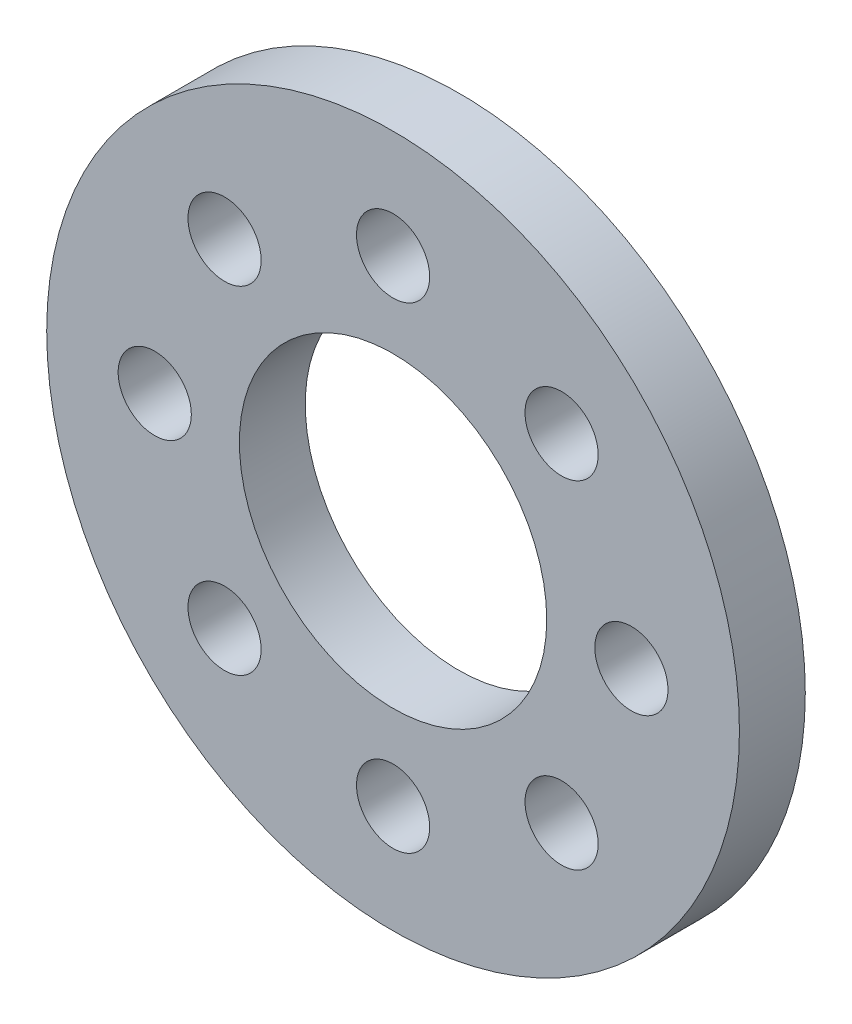
ISO-10303-21;
HEADER;
FILE_DESCRIPTION(('STEP AP214'),'2;1');
FILE_NAME('part.step','',(''),(''),'','','');
FILE_SCHEMA(('AUTOMOTIVE_DESIGN { 1 0 10303 214 1 1 1 1 }'));
ENDSEC;
DATA;
#1=APPLICATION_CONTEXT('core data for automotive mechanical design processes');
#2=APPLICATION_PROTOCOL_DEFINITION('international standard','automotive_design',2000,#1);
#3=PRODUCT_CONTEXT('',#1,'mechanical');
#4=PRODUCT('Part','Part','',(#3));
#5=PRODUCT_RELATED_PRODUCT_CATEGORY('part','',(#4));
#6=PRODUCT_DEFINITION_FORMATION('','',#4);
#7=PRODUCT_DEFINITION_CONTEXT('part definition',#1,'design');
#8=PRODUCT_DEFINITION('design','',#6,#7);
#9=PRODUCT_DEFINITION_SHAPE('','',#8);
#10=(LENGTH_UNIT() NAMED_UNIT(*) SI_UNIT(.MILLI.,.METRE.));
#11=(NAMED_UNIT(*) PLANE_ANGLE_UNIT() SI_UNIT($,.RADIAN.));
#12=(NAMED_UNIT(*) SI_UNIT($,.STERADIAN.) SOLID_ANGLE_UNIT());
#13=UNCERTAINTY_MEASURE_WITH_UNIT(LENGTH_MEASURE(1.E-05),#10,'distance_accuracy_value','');
#14=(GEOMETRIC_REPRESENTATION_CONTEXT(3) GLOBAL_UNCERTAINTY_ASSIGNED_CONTEXT((#13)) GLOBAL_UNIT_ASSIGNED_CONTEXT((#10,
#11,#12)) REPRESENTATION_CONTEXT('',''));
#15=CARTESIAN_POINT('',(0.,0.,0.));
#16=DIRECTION('',(0.,0.,1.));
#17=DIRECTION('',(1.,0.,0.));
#18=AXIS2_PLACEMENT_3D('',#15,#16,#17);
#19=CARTESIAN_POINT('',(0.,0.,2.7));
#20=DIRECTION('',(0.,0.,1.));
#21=DIRECTION('',(1.,0.,0.));
#22=AXIS2_PLACEMENT_3D('',#19,#20,#21);
#23=PLANE('',#22);
#24=CARTESIAN_POINT('',(-9.76999999999958,-4.16520151702571E-13,2.7));
#25=DIRECTION('',(0.,0.,1.));
#26=DIRECTION('',(1.,0.,0.));
#27=AXIS2_PLACEMENT_3D('',#24,#25,#26);
#28=CIRCLE('',#27,1.50000000000062);
#29=CARTESIAN_POINT('',(-8.26999999999896,-4.16520151702571E-13,2.7));
#30=VERTEX_POINT('',#29);
#31=EDGE_CURVE('E82',#30,#30,#28,.T.);
#32=ORIENTED_EDGE('',*,*,#31,.F.);
#33=EDGE_LOOP('',(#32));
#34=FACE_BOUND('',#33,.T.);
#35=CARTESIAN_POINT('',(8.31593995535348E-13,-9.77,2.7));
#36=DIRECTION('',(0.,0.,1.));
#37=DIRECTION('',(1.,0.,0.));
#38=AXIS2_PLACEMENT_3D('',#35,#36,#37);
#39=CIRCLE('',#38,1.50000000000086);
#40=CARTESIAN_POINT('',(1.50000000000169,-9.77,2.7));
#41=VERTEX_POINT('',#40);
#42=EDGE_CURVE('E70',#41,#41,#39,.T.);
#43=ORIENTED_EDGE('',*,*,#42,.F.);
#44=EDGE_LOOP('',(#43));
#45=FACE_BOUND('',#44,.T.);
#46=CARTESIAN_POINT('',(9.77000000000042,4.15323671779804E-13,2.7));
#47=DIRECTION('',(0.,0.,1.));
#48=DIRECTION('',(1.,0.,0.));
#49=AXIS2_PLACEMENT_3D('',#46,#47,#48);
#50=CIRCLE('',#49,1.50000000000031);
#51=CARTESIAN_POINT('',(11.2700000000007,4.15323671779804E-13,2.7));
#52=VERTEX_POINT('',#51);
#53=EDGE_CURVE('E58',#52,#52,#50,.T.);
#54=ORIENTED_EDGE('',*,*,#53,.F.);
#55=EDGE_LOOP('',(#54));
#56=FACE_BOUND('',#55,.T.);
#57=CARTESIAN_POINT('',(0.,9.77,2.7));
#58=DIRECTION('',(0.,0.,1.));
#59=DIRECTION('',(1.,0.,0.));
#60=AXIS2_PLACEMENT_3D('',#57,#58,#59);
#61=CIRCLE('',#60,1.5);
#62=CARTESIAN_POINT('',(1.5,9.77,2.7));
#63=VERTEX_POINT('',#62);
#64=EDGE_CURVE('E46',#63,#63,#61,.T.);
#65=ORIENTED_EDGE('',*,*,#64,.F.);
#66=EDGE_LOOP('',(#65));
#67=FACE_BOUND('',#66,.T.);
#68=CARTESIAN_POINT('',(0.,0.,2.7));
#69=DIRECTION('',(0.,0.,1.));
#70=DIRECTION('',(1.,0.,0.));
#71=AXIS2_PLACEMENT_3D('',#68,#69,#70);
#72=CIRCLE('',#71,14.2);
#73=CARTESIAN_POINT('',(14.2,0.,2.7));
#74=VERTEX_POINT('',#73);
#75=EDGE_CURVE('E10',#74,#74,#72,.T.);
#76=ORIENTED_EDGE('',*,*,#75,.T.);
#77=EDGE_LOOP('',(#76));
#78=FACE_BOUND('',#77,.T.);
#79=CARTESIAN_POINT('',(0.,0.,2.7));
#80=DIRECTION('',(0.,0.,1.));
#81=DIRECTION('',(1.,0.,0.));
#82=AXIS2_PLACEMENT_3D('',#79,#80,#81);
#83=CIRCLE('',#82,6.3);
#84=CARTESIAN_POINT('',(6.3,0.,2.7));
#85=VERTEX_POINT('',#84);
#86=EDGE_CURVE('E41',#85,#85,#83,.T.);
#87=ORIENTED_EDGE('',*,*,#86,.F.);
#88=EDGE_LOOP('',(#87));
#89=FACE_BOUND('',#88,.T.);
#90=CARTESIAN_POINT('',(6.90843325219269,6.90843325219286,2.7));
#91=DIRECTION('',(0.,0.,1.));
#92=DIRECTION('',(1.,0.,0.));
#93=AXIS2_PLACEMENT_3D('',#90,#91,#92);
#94=CIRCLE('',#93,1.50000000000005);
#95=CARTESIAN_POINT('',(8.40843325219274,6.90843325219286,2.7));
#96=VERTEX_POINT('',#95);
#97=EDGE_CURVE('E52',#96,#96,#94,.T.);
#98=ORIENTED_EDGE('',*,*,#97,.F.);
#99=EDGE_LOOP('',(#98));
#100=FACE_BOUND('',#99,.T.);
#101=CARTESIAN_POINT('',(6.90843325219328,-6.90843325219228,2.7));
#102=DIRECTION('',(0.,0.,1.));
#103=DIRECTION('',(1.,0.,0.));
#104=AXIS2_PLACEMENT_3D('',#101,#102,#103);
#105=CIRCLE('',#104,1.50000000000064);
#106=CARTESIAN_POINT('',(8.40843325219392,-6.90843325219228,2.7));
#107=VERTEX_POINT('',#106);
#108=EDGE_CURVE('E64',#107,#107,#105,.T.);
#109=ORIENTED_EDGE('',*,*,#108,.F.);
#110=EDGE_LOOP('',(#109));
#111=FACE_BOUND('',#110,.T.);
#112=CARTESIAN_POINT('',(-6.90843325219186,-6.90843325219286,2.7));
#113=DIRECTION('',(0.,0.,1.));
#114=DIRECTION('',(1.,0.,0.));
#115=AXIS2_PLACEMENT_3D('',#112,#113,#114);
#116=CIRCLE('',#115,1.50000000000085);
#117=CARTESIAN_POINT('',(-5.40843325219101,-6.90843325219286,2.7));
#118=VERTEX_POINT('',#117);
#119=EDGE_CURVE('E76',#118,#118,#116,.T.);
#120=ORIENTED_EDGE('',*,*,#119,.F.);
#121=EDGE_LOOP('',(#120));
#122=FACE_BOUND('',#121,.T.);
#123=CARTESIAN_POINT('',(-6.90843325219245,6.90843325219227,2.7));
#124=DIRECTION('',(0.,0.,1.));
#125=DIRECTION('',(1.,0.,0.));
#126=AXIS2_PLACEMENT_3D('',#123,#124,#125);
#127=CIRCLE('',#126,1.50000000000032);
#128=CARTESIAN_POINT('',(-5.40843325219213,6.90843325219227,2.7));
#129=VERTEX_POINT('',#128);
#130=EDGE_CURVE('E88',#129,#129,#127,.T.);
#131=ORIENTED_EDGE('',*,*,#130,.F.);
#132=EDGE_LOOP('',(#131));
#133=FACE_BOUND('',#132,.T.);
#134=ADVANCED_FACE('F30',(#34,#45,#56,#67,#78,#89,#100,#111,#122,#133),#23,.T.);
#135=CARTESIAN_POINT('',(0.,0.,0.));
#136=DIRECTION('',(0.,0.,1.));
#137=DIRECTION('',(1.,0.,0.));
#138=AXIS2_PLACEMENT_3D('',#135,#136,#137);
#139=PLANE('',#138);
#140=CARTESIAN_POINT('',(-9.76999999999958,-4.16520151702571E-13,0.));
#141=DIRECTION('',(0.,0.,1.));
#142=DIRECTION('',(1.,0.,0.));
#143=AXIS2_PLACEMENT_3D('',#140,#141,#142);
#144=CIRCLE('',#143,1.50000000000062);
#145=CARTESIAN_POINT('',(-8.26999999999896,-4.16520151702571E-13,0.));
#146=VERTEX_POINT('',#145);
#147=EDGE_CURVE('E85',#146,#146,#144,.T.);
#148=ORIENTED_EDGE('',*,*,#147,.T.);
#149=EDGE_LOOP('',(#148));
#150=FACE_BOUND('',#149,.T.);
#151=CARTESIAN_POINT('',(8.31593995535348E-13,-9.77,0.));
#152=DIRECTION('',(0.,0.,1.));
#153=DIRECTION('',(1.,0.,0.));
#154=AXIS2_PLACEMENT_3D('',#151,#152,#153);
#155=CIRCLE('',#154,1.50000000000086);
#156=CARTESIAN_POINT('',(1.50000000000169,-9.77,0.));
#157=VERTEX_POINT('',#156);
#158=EDGE_CURVE('E73',#157,#157,#155,.T.);
#159=ORIENTED_EDGE('',*,*,#158,.T.);
#160=EDGE_LOOP('',(#159));
#161=FACE_BOUND('',#160,.T.);
#162=CARTESIAN_POINT('',(9.77000000000042,4.15323671779804E-13,0.));
#163=DIRECTION('',(0.,0.,1.));
#164=DIRECTION('',(1.,0.,0.));
#165=AXIS2_PLACEMENT_3D('',#162,#163,#164);
#166=CIRCLE('',#165,1.50000000000031);
#167=CARTESIAN_POINT('',(11.2700000000007,4.15323671779804E-13,0.));
#168=VERTEX_POINT('',#167);
#169=EDGE_CURVE('E61',#168,#168,#166,.T.);
#170=ORIENTED_EDGE('',*,*,#169,.T.);
#171=EDGE_LOOP('',(#170));
#172=FACE_BOUND('',#171,.T.);
#173=CARTESIAN_POINT('',(0.,9.77,0.));
#174=DIRECTION('',(0.,0.,1.));
#175=DIRECTION('',(1.,0.,0.));
#176=AXIS2_PLACEMENT_3D('',#173,#174,#175);
#177=CIRCLE('',#176,1.5);
#178=CARTESIAN_POINT('',(1.5,9.77,0.));
#179=VERTEX_POINT('',#178);
#180=EDGE_CURVE('E49',#179,#179,#177,.T.);
#181=ORIENTED_EDGE('',*,*,#180,.T.);
#182=EDGE_LOOP('',(#181));
#183=FACE_BOUND('',#182,.T.);
#184=CARTESIAN_POINT('',(0.,0.,0.));
#185=DIRECTION('',(0.,0.,1.));
#186=DIRECTION('',(1.,0.,0.));
#187=AXIS2_PLACEMENT_3D('',#184,#185,#186);
#188=CIRCLE('',#187,14.2);
#189=CARTESIAN_POINT('',(14.2,0.,0.));
#190=VERTEX_POINT('',#189);
#191=EDGE_CURVE('E34',#190,#190,#188,.T.);
#192=ORIENTED_EDGE('',*,*,#191,.F.);
#193=EDGE_LOOP('',(#192));
#194=FACE_BOUND('',#193,.T.);
#195=CARTESIAN_POINT('',(0.,0.,0.));
#196=DIRECTION('',(0.,0.,1.));
#197=DIRECTION('',(1.,0.,0.));
#198=AXIS2_PLACEMENT_3D('',#195,#196,#197);
#199=CIRCLE('',#198,6.3);
#200=CARTESIAN_POINT('',(6.3,0.,0.));
#201=VERTEX_POINT('',#200);
#202=EDGE_CURVE('E43',#201,#201,#199,.T.);
#203=ORIENTED_EDGE('',*,*,#202,.T.);
#204=EDGE_LOOP('',(#203));
#205=FACE_BOUND('',#204,.T.);
#206=CARTESIAN_POINT('',(6.90843325219269,6.90843325219286,0.));
#207=DIRECTION('',(0.,0.,1.));
#208=DIRECTION('',(1.,0.,0.));
#209=AXIS2_PLACEMENT_3D('',#206,#207,#208);
#210=CIRCLE('',#209,1.50000000000005);
#211=CARTESIAN_POINT('',(8.40843325219274,6.90843325219286,0.));
#212=VERTEX_POINT('',#211);
#213=EDGE_CURVE('E55',#212,#212,#210,.T.);
#214=ORIENTED_EDGE('',*,*,#213,.T.);
#215=EDGE_LOOP('',(#214));
#216=FACE_BOUND('',#215,.T.);
#217=CARTESIAN_POINT('',(6.90843325219328,-6.90843325219228,0.));
#218=DIRECTION('',(0.,0.,1.));
#219=DIRECTION('',(1.,0.,0.));
#220=AXIS2_PLACEMENT_3D('',#217,#218,#219);
#221=CIRCLE('',#220,1.50000000000064);
#222=CARTESIAN_POINT('',(8.40843325219392,-6.90843325219228,0.));
#223=VERTEX_POINT('',#222);
#224=EDGE_CURVE('E67',#223,#223,#221,.T.);
#225=ORIENTED_EDGE('',*,*,#224,.T.);
#226=EDGE_LOOP('',(#225));
#227=FACE_BOUND('',#226,.T.);
#228=CARTESIAN_POINT('',(-6.90843325219186,-6.90843325219286,0.));
#229=DIRECTION('',(0.,0.,1.));
#230=DIRECTION('',(1.,0.,0.));
#231=AXIS2_PLACEMENT_3D('',#228,#229,#230);
#232=CIRCLE('',#231,1.50000000000085);
#233=CARTESIAN_POINT('',(-5.40843325219101,-6.90843325219286,0.));
#234=VERTEX_POINT('',#233);
#235=EDGE_CURVE('E79',#234,#234,#232,.T.);
#236=ORIENTED_EDGE('',*,*,#235,.T.);
#237=EDGE_LOOP('',(#236));
#238=FACE_BOUND('',#237,.T.);
#239=CARTESIAN_POINT('',(-6.90843325219245,6.90843325219227,0.));
#240=DIRECTION('',(0.,0.,1.));
#241=DIRECTION('',(1.,0.,0.));
#242=AXIS2_PLACEMENT_3D('',#239,#240,#241);
#243=CIRCLE('',#242,1.50000000000032);
#244=CARTESIAN_POINT('',(-5.40843325219213,6.90843325219227,0.));
#245=VERTEX_POINT('',#244);
#246=EDGE_CURVE('E91',#245,#245,#243,.T.);
#247=ORIENTED_EDGE('',*,*,#246,.T.);
#248=EDGE_LOOP('',(#247));
#249=FACE_BOUND('',#248,.T.);
#250=ADVANCED_FACE('F101',(#150,#161,#172,#183,#194,#205,#216,#227,#238,#249),#139,.F.);
#251=CARTESIAN_POINT('',(0.,0.,2.7));
#252=DIRECTION('',(0.,0.,-1.));
#253=DIRECTION('',(-1.,0.,0.));
#254=AXIS2_PLACEMENT_3D('',#251,#252,#253);
#255=CYLINDRICAL_SURFACE('',#254,14.2);
#256=ORIENTED_EDGE('',*,*,#75,.F.);
#257=EDGE_LOOP('',(#256));
#258=FACE_BOUND('',#257,.T.);
#259=ORIENTED_EDGE('',*,*,#191,.T.);
#260=EDGE_LOOP('',(#259));
#261=FACE_BOUND('',#260,.T.);
#262=ADVANCED_FACE('F32',(#258,#261),#255,.T.);
#263=CARTESIAN_POINT('',(0.,0.,2.7));
#264=DIRECTION('',(0.,0.,-1.));
#265=DIRECTION('',(-1.,0.,0.));
#266=AXIS2_PLACEMENT_3D('',#263,#264,#265);
#267=CYLINDRICAL_SURFACE('',#266,6.3);
#268=ORIENTED_EDGE('',*,*,#86,.T.);
#269=EDGE_LOOP('',(#268));
#270=FACE_BOUND('',#269,.T.);
#271=ORIENTED_EDGE('',*,*,#202,.F.);
#272=EDGE_LOOP('',(#271));
#273=FACE_BOUND('',#272,.T.);
#274=ADVANCED_FACE('F111',(#270,#273),#267,.F.);
#275=CARTESIAN_POINT('',(0.,9.77,2.7));
#276=DIRECTION('',(0.,0.,-1.));
#277=DIRECTION('',(-1.,0.,0.));
#278=AXIS2_PLACEMENT_3D('',#275,#276,#277);
#279=CYLINDRICAL_SURFACE('',#278,1.5);
#280=ORIENTED_EDGE('',*,*,#64,.T.);
#281=EDGE_LOOP('',(#280));
#282=FACE_BOUND('',#281,.T.);
#283=ORIENTED_EDGE('',*,*,#180,.F.);
#284=EDGE_LOOP('',(#283));
#285=FACE_BOUND('',#284,.T.);
#286=ADVANCED_FACE('F114',(#282,#285),#279,.F.);
#287=CARTESIAN_POINT('',(6.90843325219269,6.90843325219286,2.7));
#288=DIRECTION('',(0.,0.,-1.));
#289=DIRECTION('',(-1.,0.,0.));
#290=AXIS2_PLACEMENT_3D('',#287,#288,#289);
#291=CYLINDRICAL_SURFACE('',#290,1.50000000000005);
#292=ORIENTED_EDGE('',*,*,#97,.T.);
#293=EDGE_LOOP('',(#292));
#294=FACE_BOUND('',#293,.T.);
#295=ORIENTED_EDGE('',*,*,#213,.F.);
#296=EDGE_LOOP('',(#295));
#297=FACE_BOUND('',#296,.T.);
#298=ADVANCED_FACE('F118',(#294,#297),#291,.F.);
#299=CARTESIAN_POINT('',(9.77000000000042,4.15323671779804E-13,2.7));
#300=DIRECTION('',(0.,0.,-1.));
#301=DIRECTION('',(-1.,0.,0.));
#302=AXIS2_PLACEMENT_3D('',#299,#300,#301);
#303=CYLINDRICAL_SURFACE('',#302,1.50000000000031);
#304=ORIENTED_EDGE('',*,*,#53,.T.);
#305=EDGE_LOOP('',(#304));
#306=FACE_BOUND('',#305,.T.);
#307=ORIENTED_EDGE('',*,*,#169,.F.);
#308=EDGE_LOOP('',(#307));
#309=FACE_BOUND('',#308,.T.);
#310=ADVANCED_FACE('F122',(#306,#309),#303,.F.);
#311=CARTESIAN_POINT('',(6.90843325219328,-6.90843325219228,2.7));
#312=DIRECTION('',(0.,0.,-1.));
#313=DIRECTION('',(-1.,0.,0.));
#314=AXIS2_PLACEMENT_3D('',#311,#312,#313);
#315=CYLINDRICAL_SURFACE('',#314,1.50000000000064);
#316=ORIENTED_EDGE('',*,*,#108,.T.);
#317=EDGE_LOOP('',(#316));
#318=FACE_BOUND('',#317,.T.);
#319=ORIENTED_EDGE('',*,*,#224,.F.);
#320=EDGE_LOOP('',(#319));
#321=FACE_BOUND('',#320,.T.);
#322=ADVANCED_FACE('F126',(#318,#321),#315,.F.);
#323=CARTESIAN_POINT('',(8.31593995535348E-13,-9.77,2.7));
#324=DIRECTION('',(0.,0.,-1.));
#325=DIRECTION('',(-1.,0.,0.));
#326=AXIS2_PLACEMENT_3D('',#323,#324,#325);
#327=CYLINDRICAL_SURFACE('',#326,1.50000000000086);
#328=ORIENTED_EDGE('',*,*,#42,.T.);
#329=EDGE_LOOP('',(#328));
#330=FACE_BOUND('',#329,.T.);
#331=ORIENTED_EDGE('',*,*,#158,.F.);
#332=EDGE_LOOP('',(#331));
#333=FACE_BOUND('',#332,.T.);
#334=ADVANCED_FACE('F130',(#330,#333),#327,.F.);
#335=CARTESIAN_POINT('',(-6.90843325219186,-6.90843325219286,2.7));
#336=DIRECTION('',(0.,0.,-1.));
#337=DIRECTION('',(-1.,0.,0.));
#338=AXIS2_PLACEMENT_3D('',#335,#336,#337);
#339=CYLINDRICAL_SURFACE('',#338,1.50000000000085);
#340=ORIENTED_EDGE('',*,*,#119,.T.);
#341=EDGE_LOOP('',(#340));
#342=FACE_BOUND('',#341,.T.);
#343=ORIENTED_EDGE('',*,*,#235,.F.);
#344=EDGE_LOOP('',(#343));
#345=FACE_BOUND('',#344,.T.);
#346=ADVANCED_FACE('F134',(#342,#345),#339,.F.);
#347=CARTESIAN_POINT('',(-9.76999999999958,-4.16520151702571E-13,2.7));
#348=DIRECTION('',(0.,0.,-1.));
#349=DIRECTION('',(-1.,0.,0.));
#350=AXIS2_PLACEMENT_3D('',#347,#348,#349);
#351=CYLINDRICAL_SURFACE('',#350,1.50000000000062);
#352=ORIENTED_EDGE('',*,*,#31,.T.);
#353=EDGE_LOOP('',(#352));
#354=FACE_BOUND('',#353,.T.);
#355=ORIENTED_EDGE('',*,*,#147,.F.);
#356=EDGE_LOOP('',(#355));
#357=FACE_BOUND('',#356,.T.);
#358=ADVANCED_FACE('F138',(#354,#357),#351,.F.);
#359=CARTESIAN_POINT('',(-6.90843325219245,6.90843325219227,2.7));
#360=DIRECTION('',(0.,0.,-1.));
#361=DIRECTION('',(-1.,0.,0.));
#362=AXIS2_PLACEMENT_3D('',#359,#360,#361);
#363=CYLINDRICAL_SURFACE('',#362,1.50000000000032);
#364=ORIENTED_EDGE('',*,*,#130,.T.);
#365=EDGE_LOOP('',(#364));
#366=FACE_BOUND('',#365,.T.);
#367=ORIENTED_EDGE('',*,*,#246,.F.);
#368=EDGE_LOOP('',(#367));
#369=FACE_BOUND('',#368,.T.);
#370=ADVANCED_FACE('F97',(#366,#369),#363,.F.);
#371=CLOSED_SHELL('',(#134,#250,#262,#274,#286,#298,#310,#322,#334,#346,#358,#370));
#372=MANIFOLD_SOLID_BREP('B2',#371);
#373=ADVANCED_BREP_SHAPE_REPRESENTATION('',(#18,#372),#14);
#374=SHAPE_DEFINITION_REPRESENTATION(#9,#373);
ENDSEC;
END-ISO-10303-21;
